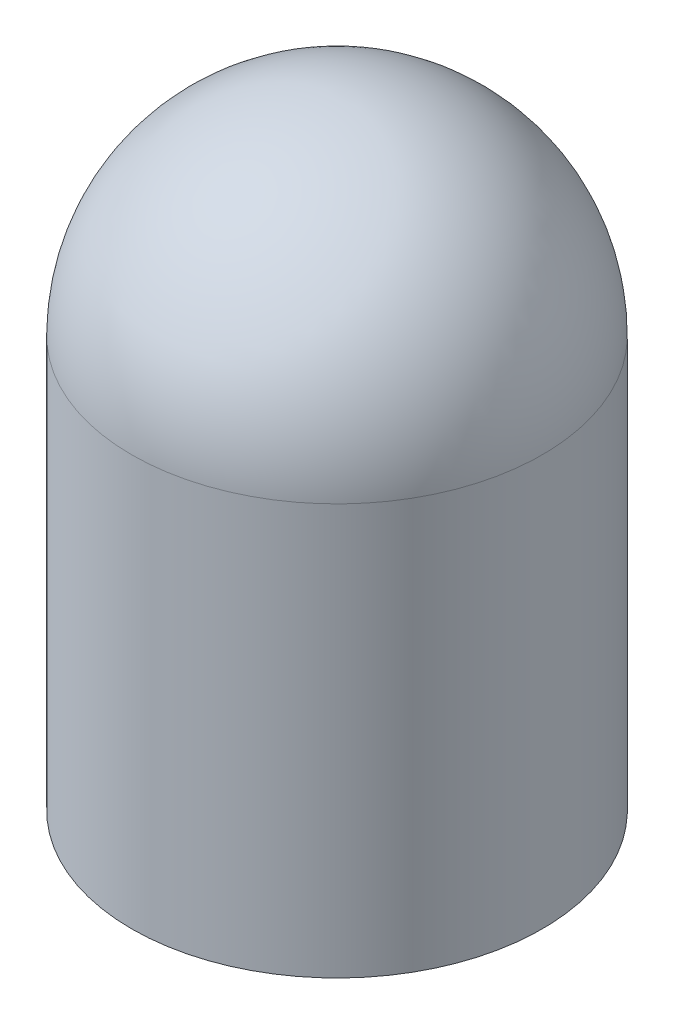
ISO-10303-21;
HEADER;
FILE_DESCRIPTION(('STEP AP214'),'2;1');
FILE_NAME('part.step','',(''),(''),'','','');
FILE_SCHEMA(('AUTOMOTIVE_DESIGN { 1 0 10303 214 1 1 1 1 }'));
ENDSEC;
DATA;
#1=APPLICATION_CONTEXT('core data for automotive mechanical design processes');
#2=APPLICATION_PROTOCOL_DEFINITION('international standard','automotive_design',2000,#1);
#3=PRODUCT_CONTEXT('',#1,'mechanical');
#4=PRODUCT('Part','Part','',(#3));
#5=PRODUCT_RELATED_PRODUCT_CATEGORY('part','',(#4));
#6=PRODUCT_DEFINITION_FORMATION('','',#4);
#7=PRODUCT_DEFINITION_CONTEXT('part definition',#1,'design');
#8=PRODUCT_DEFINITION('design','',#6,#7);
#9=PRODUCT_DEFINITION_SHAPE('','',#8);
#10=(LENGTH_UNIT() NAMED_UNIT(*) SI_UNIT(.MILLI.,.METRE.));
#11=(NAMED_UNIT(*) PLANE_ANGLE_UNIT() SI_UNIT($,.RADIAN.));
#12=(NAMED_UNIT(*) SI_UNIT($,.STERADIAN.) SOLID_ANGLE_UNIT());
#13=UNCERTAINTY_MEASURE_WITH_UNIT(LENGTH_MEASURE(1.E-05),#10,'distance_accuracy_value','');
#14=(GEOMETRIC_REPRESENTATION_CONTEXT(3) GLOBAL_UNCERTAINTY_ASSIGNED_CONTEXT((#13)) GLOBAL_UNIT_ASSIGNED_CONTEXT((#10,
#11,#12)) REPRESENTATION_CONTEXT('',''));
#15=CARTESIAN_POINT('',(0.,0.,0.));
#16=DIRECTION('',(0.,0.,1.));
#17=DIRECTION('',(1.,0.,0.));
#18=AXIS2_PLACEMENT_3D('',#15,#16,#17);
#19=CARTESIAN_POINT('',(0.,9.525,0.));
#20=DIRECTION('',(0.,-1.,0.));
#21=DIRECTION('',(0.,0.,-1.));
#22=AXIS2_PLACEMENT_3D('',#19,#20,#21);
#23=CYLINDRICAL_SURFACE('',#22,3.175);
#24=CARTESIAN_POINT('',(0.,6.35,0.));
#25=DIRECTION('',(0.,-1.,0.));
#26=DIRECTION('',(0.,0.,-1.));
#27=AXIS2_PLACEMENT_3D('',#24,#25,#26);
#28=CIRCLE('',#27,3.175);
#29=CARTESIAN_POINT('',(0.,6.35,-3.175));
#30=VERTEX_POINT('',#29);
#31=EDGE_CURVE('E10',#30,#30,#28,.T.);
#32=ORIENTED_EDGE('',*,*,#31,.T.);
#33=EDGE_LOOP('',(#32));
#34=FACE_BOUND('',#33,.T.);
#35=CARTESIAN_POINT('',(0.,0.,0.));
#36=DIRECTION('',(0.,1.,0.));
#37=DIRECTION('',(0.,0.,1.));
#38=AXIS2_PLACEMENT_3D('',#35,#36,#37);
#39=CIRCLE('',#38,3.175);
#40=CARTESIAN_POINT('',(0.,0.,3.175));
#41=VERTEX_POINT('',#40);
#42=EDGE_CURVE('E35',#41,#41,#39,.T.);
#43=ORIENTED_EDGE('',*,*,#42,.T.);
#44=EDGE_LOOP('',(#43));
#45=FACE_BOUND('',#44,.T.);
#46=ADVANCED_FACE('F28',(#34,#45),#23,.T.);
#47=CARTESIAN_POINT('',(0.,0.,0.));
#48=DIRECTION('',(0.,1.,0.));
#49=DIRECTION('',(0.,0.,1.));
#50=AXIS2_PLACEMENT_3D('',#47,#48,#49);
#51=PLANE('',#50);
#52=ORIENTED_EDGE('',*,*,#42,.F.);
#53=EDGE_LOOP('',(#52));
#54=FACE_BOUND('',#53,.T.);
#55=ADVANCED_FACE('F42',(#54),#51,.F.);
#56=CARTESIAN_POINT('',(0.,6.35,0.));
#57=DIRECTION('',(0.,0.,1.));
#58=DIRECTION('',(1.,0.,0.));
#59=AXIS2_PLACEMENT_3D('',#56,#57,#58);
#60=SPHERICAL_SURFACE('',#59,3.175);
#61=CARTESIAN_POINT('',(0.,6.35,0.));
#62=DIRECTION('',(0.,-1.,0.));
#63=DIRECTION('',(0.,0.,-1.));
#64=AXIS2_PLACEMENT_3D('',#61,#62,#63);
#65=SPHERICAL_SURFACE('',#64,3.175);
#66=ORIENTED_EDGE('',*,*,#31,.F.);
#67=EDGE_LOOP('',(#66));
#68=FACE_BOUND('',#67,.T.);
#69=ADVANCED_FACE('F30',(#68),#65,.T.);
#70=CLOSED_SHELL('',(#46,#55,#69));
#71=MANIFOLD_SOLID_BREP('B2',#70);
#72=ADVANCED_BREP_SHAPE_REPRESENTATION('',(#18,#71),#14);
#73=SHAPE_DEFINITION_REPRESENTATION(#9,#72);
ENDSEC;
END-ISO-10303-21;
